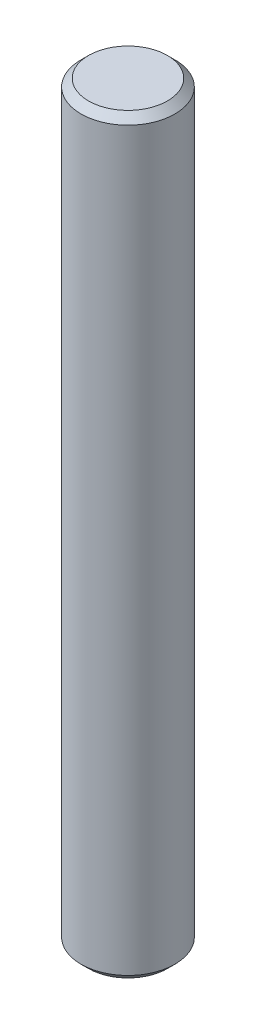
ISO-10303-21;
HEADER;
FILE_DESCRIPTION(('STEP AP214'),'2;1');
FILE_NAME('part.step','',(''),(''),'','','');
FILE_SCHEMA(('AUTOMOTIVE_DESIGN { 1 0 10303 214 1 1 1 1 }'));
ENDSEC;
DATA;
#1=APPLICATION_CONTEXT('core data for automotive mechanical design processes');
#2=APPLICATION_PROTOCOL_DEFINITION('international standard','automotive_design',2000,#1);
#3=PRODUCT_CONTEXT('',#1,'mechanical');
#4=PRODUCT('Part','Part','',(#3));
#5=PRODUCT_RELATED_PRODUCT_CATEGORY('part','',(#4));
#6=PRODUCT_DEFINITION_FORMATION('','',#4);
#7=PRODUCT_DEFINITION_CONTEXT('part definition',#1,'design');
#8=PRODUCT_DEFINITION('design','',#6,#7);
#9=PRODUCT_DEFINITION_SHAPE('','',#8);
#10=(LENGTH_UNIT() NAMED_UNIT(*) SI_UNIT(.MILLI.,.METRE.));
#11=(NAMED_UNIT(*) PLANE_ANGLE_UNIT() SI_UNIT($,.RADIAN.));
#12=(NAMED_UNIT(*) SI_UNIT($,.STERADIAN.) SOLID_ANGLE_UNIT());
#13=UNCERTAINTY_MEASURE_WITH_UNIT(LENGTH_MEASURE(1.E-05),#10,'distance_accuracy_value','');
#14=(GEOMETRIC_REPRESENTATION_CONTEXT(3) GLOBAL_UNCERTAINTY_ASSIGNED_CONTEXT((#13)) GLOBAL_UNIT_ASSIGNED_CONTEXT((#10,
#11,#12)) REPRESENTATION_CONTEXT('',''));
#15=CARTESIAN_POINT('',(0.,0.,0.));
#16=DIRECTION('',(0.,0.,1.));
#17=DIRECTION('',(1.,0.,0.));
#18=AXIS2_PLACEMENT_3D('',#15,#16,#17);
#19=CARTESIAN_POINT('',(0.,100.,0.));
#20=DIRECTION('',(0.,-1.,0.));
#21=DIRECTION('',(0.,0.,-1.));
#22=AXIS2_PLACEMENT_3D('',#19,#20,#21);
#23=CYLINDRICAL_SURFACE('',#22,12.5);
#24=CARTESIAN_POINT('',(0.,-98.0000000000001,0.));
#25=DIRECTION('',(0.,1.,0.));
#26=DIRECTION('',(0.,0.,1.));
#27=AXIS2_PLACEMENT_3D('',#24,#25,#26);
#28=CIRCLE('',#27,12.5);
#29=CARTESIAN_POINT('',(0.,-98.0000000000001,12.5));
#30=VERTEX_POINT('',#29);
#31=EDGE_CURVE('E42',#30,#30,#28,.T.);
#32=ORIENTED_EDGE('',*,*,#31,.T.);
#33=EDGE_LOOP('',(#32));
#34=FACE_BOUND('',#33,.T.);
#35=CARTESIAN_POINT('',(0.,98.,0.));
#36=DIRECTION('',(0.,1.,0.));
#37=DIRECTION('',(0.,0.,1.));
#38=AXIS2_PLACEMENT_3D('',#35,#36,#37);
#39=CIRCLE('',#38,12.5);
#40=CARTESIAN_POINT('',(0.,98.,12.5));
#41=VERTEX_POINT('',#40);
#42=EDGE_CURVE('E46',#41,#41,#39,.F.);
#43=ORIENTED_EDGE('',*,*,#42,.T.);
#44=EDGE_LOOP('',(#43));
#45=FACE_BOUND('',#44,.T.);
#46=ADVANCED_FACE('F31',(#34,#45),#23,.T.);
#47=CARTESIAN_POINT('',(0.,100.,0.));
#48=DIRECTION('',(0.,1.,0.));
#49=DIRECTION('',(0.,0.,1.));
#50=AXIS2_PLACEMENT_3D('',#47,#48,#49);
#51=PLANE('',#50);
#52=CARTESIAN_POINT('',(0.,100.,0.));
#53=DIRECTION('',(0.,1.,0.));
#54=DIRECTION('',(0.,0.,1.));
#55=AXIS2_PLACEMENT_3D('',#52,#53,#54);
#56=CIRCLE('',#55,10.5);
#57=CARTESIAN_POINT('',(0.,100.,10.5));
#58=VERTEX_POINT('',#57);
#59=EDGE_CURVE('E10',#58,#58,#56,.T.);
#60=ORIENTED_EDGE('',*,*,#59,.T.);
#61=EDGE_LOOP('',(#60));
#62=FACE_BOUND('',#61,.T.);
#63=ADVANCED_FACE('F62',(#62),#51,.T.);
#64=CARTESIAN_POINT('',(0.,-100.,0.));
#65=DIRECTION('',(0.,1.,0.));
#66=DIRECTION('',(0.,0.,1.));
#67=AXIS2_PLACEMENT_3D('',#64,#65,#66);
#68=PLANE('',#67);
#69=CARTESIAN_POINT('',(0.,-100.,0.));
#70=DIRECTION('',(0.,1.,0.));
#71=DIRECTION('',(0.,0.,1.));
#72=AXIS2_PLACEMENT_3D('',#69,#70,#71);
#73=CIRCLE('',#72,10.5);
#74=CARTESIAN_POINT('',(0.,-100.,10.5));
#75=VERTEX_POINT('',#74);
#76=EDGE_CURVE('E38',#75,#75,#73,.F.);
#77=ORIENTED_EDGE('',*,*,#76,.T.);
#78=EDGE_LOOP('',(#77));
#79=FACE_BOUND('',#78,.T.);
#80=ADVANCED_FACE('F59',(#79),#68,.F.);
#81=CARTESIAN_POINT('',(0.,-98.0000000000001,0.));
#82=DIRECTION('',(0.,1.,0.));
#83=DIRECTION('',(0.,0.,1.));
#84=AXIS2_PLACEMENT_3D('',#81,#82,#83);
#85=CONICAL_SURFACE('',#84,12.5,0.78539816339746);
#86=ORIENTED_EDGE('',*,*,#76,.F.);
#87=EDGE_LOOP('',(#86));
#88=FACE_BOUND('',#87,.T.);
#89=ORIENTED_EDGE('',*,*,#31,.F.);
#90=EDGE_LOOP('',(#89));
#91=FACE_BOUND('',#90,.T.);
#92=ADVANCED_FACE('F55',(#88,#91),#85,.T.);
#93=CARTESIAN_POINT('',(0.,100.,0.));
#94=DIRECTION('',(0.,-1.,0.));
#95=DIRECTION('',(0.,0.,-1.));
#96=AXIS2_PLACEMENT_3D('',#93,#94,#95);
#97=CONICAL_SURFACE('',#96,10.5,0.785398163397446);
#98=ORIENTED_EDGE('',*,*,#42,.F.);
#99=EDGE_LOOP('',(#98));
#100=FACE_BOUND('',#99,.T.);
#101=ORIENTED_EDGE('',*,*,#59,.F.);
#102=EDGE_LOOP('',(#101));
#103=FACE_BOUND('',#102,.T.);
#104=ADVANCED_FACE('F33',(#100,#103),#97,.T.);
#105=CLOSED_SHELL('',(#46,#63,#80,#92,#104));
#106=MANIFOLD_SOLID_BREP('B2',#105);
#107=ADVANCED_BREP_SHAPE_REPRESENTATION('',(#18,#106),#14);
#108=SHAPE_DEFINITION_REPRESENTATION(#9,#107);
ENDSEC;
END-ISO-10303-21;
